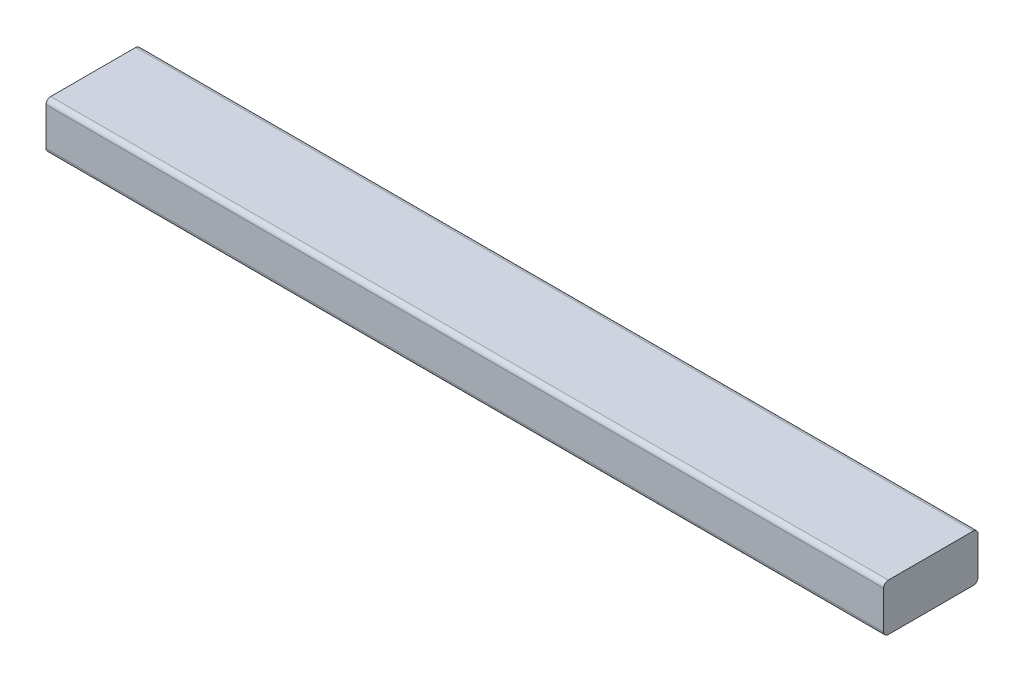
ISO-10303-21;
HEADER;
FILE_DESCRIPTION(('STEP AP214'),'2;1');
FILE_NAME('part.step','',(''),(''),'','','');
FILE_SCHEMA(('AUTOMOTIVE_DESIGN { 1 0 10303 214 1 1 1 1 }'));
ENDSEC;
DATA;
#1=APPLICATION_CONTEXT('core data for automotive mechanical design processes');
#2=APPLICATION_PROTOCOL_DEFINITION('international standard','automotive_design',2000,#1);
#3=PRODUCT_CONTEXT('',#1,'mechanical');
#4=PRODUCT('Part','Part','',(#3));
#5=PRODUCT_RELATED_PRODUCT_CATEGORY('part','',(#4));
#6=PRODUCT_DEFINITION_FORMATION('','',#4);
#7=PRODUCT_DEFINITION_CONTEXT('part definition',#1,'design');
#8=PRODUCT_DEFINITION('design','',#6,#7);
#9=PRODUCT_DEFINITION_SHAPE('','',#8);
#10=(LENGTH_UNIT() NAMED_UNIT(*) SI_UNIT(.MILLI.,.METRE.));
#11=(NAMED_UNIT(*) PLANE_ANGLE_UNIT() SI_UNIT($,.RADIAN.));
#12=(NAMED_UNIT(*) SI_UNIT($,.STERADIAN.) SOLID_ANGLE_UNIT());
#13=UNCERTAINTY_MEASURE_WITH_UNIT(LENGTH_MEASURE(1.E-05),#10,'distance_accuracy_value','');
#14=(GEOMETRIC_REPRESENTATION_CONTEXT(3) GLOBAL_UNCERTAINTY_ASSIGNED_CONTEXT((#13)) GLOBAL_UNIT_ASSIGNED_CONTEXT((#10,
#11,#12)) REPRESENTATION_CONTEXT('',''));
#15=CARTESIAN_POINT('',(0.,0.,0.));
#16=DIRECTION('',(0.,0.,1.));
#17=DIRECTION('',(1.,0.,0.));
#18=AXIS2_PLACEMENT_3D('',#15,#16,#17);
#19=CARTESIAN_POINT('',(2714.29999999996,38.0999999999986,-389.300000000002));
#20=DIRECTION('',(1.,0.,0.));
#21=DIRECTION('',(0.,1.,0.));
#22=AXIS2_PLACEMENT_3D('',#19,#20,#21);
#23=PLANE('',#22);
#24=DIRECTION('',(0.,-1.,0.));
#25=VECTOR('',#24,1.);
#26=CARTESIAN_POINT('',(2714.29999999996,38.1000000000004,-287.700000000002));
#27=LINE('',#26,#25);
#28=CARTESIAN_POINT('',(2714.29999999996,33.0200000000004,-287.700000000002));
#29=VERTEX_POINT('',#28);
#30=CARTESIAN_POINT('',(2714.29999999996,-7.61999999999961,-287.700000000001));
#31=VERTEX_POINT('',#30);
#32=EDGE_CURVE('E172',#29,#31,#27,.T.);
#33=ORIENTED_EDGE('',*,*,#32,.T.);
#34=CARTESIAN_POINT('',(2714.29999999996,-7.6199999999997,-292.780000000001));
#35=DIRECTION('',(1.,0.,0.));
#36=DIRECTION('',(0.,1.,0.));
#37=AXIS2_PLACEMENT_3D('',#34,#35,#36);
#38=CIRCLE('',#37,5.08);
#39=CARTESIAN_POINT('',(2714.29999999996,-12.6999999999997,-292.780000000001));
#40=VERTEX_POINT('',#39);
#41=EDGE_CURVE('E135',#31,#40,#38,.T.);
#42=ORIENTED_EDGE('',*,*,#41,.T.);
#43=DIRECTION('',(0.,0.,1.));
#44=VECTOR('',#43,1.);
#45=CARTESIAN_POINT('',(2714.29999999996,-12.7000000000014,-389.300000000001));
#46=LINE('',#45,#44);
#47=CARTESIAN_POINT('',(2714.29999999996,-12.7000000000013,-384.220000000001));
#48=VERTEX_POINT('',#47);
#49=EDGE_CURVE('E143',#48,#40,#46,.T.);
#50=ORIENTED_EDGE('',*,*,#49,.F.);
#51=CARTESIAN_POINT('',(2714.29999999996,-7.62000000000135,-384.220000000001));
#52=DIRECTION('',(1.,0.,0.));
#53=DIRECTION('',(0.,1.,0.));
#54=AXIS2_PLACEMENT_3D('',#51,#52,#53);
#55=CIRCLE('',#54,5.08);
#56=CARTESIAN_POINT('',(2714.29999999996,-7.62000000000144,-389.300000000001));
#57=VERTEX_POINT('',#56);
#58=EDGE_CURVE('E126',#48,#57,#55,.T.);
#59=ORIENTED_EDGE('',*,*,#58,.T.);
#60=DIRECTION('',(0.,-1.,0.));
#61=VECTOR('',#60,1.);
#62=CARTESIAN_POINT('',(2714.29999999996,38.0999999999986,-389.300000000002));
#63=LINE('',#62,#61);
#64=CARTESIAN_POINT('',(2714.29999999996,33.0199999999986,-389.300000000002));
#65=VERTEX_POINT('',#64);
#66=EDGE_CURVE('E149',#65,#57,#63,.T.);
#67=ORIENTED_EDGE('',*,*,#66,.F.);
#68=CARTESIAN_POINT('',(2714.29999999996,33.0199999999986,-384.220000000002));
#69=DIRECTION('',(1.,0.,0.));
#70=DIRECTION('',(0.,1.,0.));
#71=AXIS2_PLACEMENT_3D('',#68,#69,#70);
#72=CIRCLE('',#71,5.08);
#73=CARTESIAN_POINT('',(2714.29999999996,38.0999999999987,-384.220000000002));
#74=VERTEX_POINT('',#73);
#75=EDGE_CURVE('E82',#65,#74,#72,.T.);
#76=ORIENTED_EDGE('',*,*,#75,.T.);
#77=DIRECTION('',(0.,0.,1.));
#78=VECTOR('',#77,1.);
#79=CARTESIAN_POINT('',(2714.29999999996,38.0999999999986,-389.300000000002));
#80=LINE('',#79,#78);
#81=CARTESIAN_POINT('',(2714.29999999996,38.1000000000003,-292.780000000002));
#82=VERTEX_POINT('',#81);
#83=EDGE_CURVE('E156',#74,#82,#80,.T.);
#84=ORIENTED_EDGE('',*,*,#83,.T.);
#85=CARTESIAN_POINT('',(2714.29999999996,33.0200000000003,-292.780000000002));
#86=DIRECTION('',(1.,0.,0.));
#87=DIRECTION('',(0.,1.,0.));
#88=AXIS2_PLACEMENT_3D('',#85,#86,#87);
#89=CIRCLE('',#88,5.08);
#90=EDGE_CURVE('E136',#82,#29,#89,.T.);
#91=ORIENTED_EDGE('',*,*,#90,.T.);
#92=EDGE_LOOP('',(#33,#42,#50,#59,#67,#76,#84,#91));
#93=FACE_BOUND('',#92,.T.);
#94=ADVANCED_FACE('F61',(#93),#23,.T.);
#95=CARTESIAN_POINT('',(2714.29999999996,38.0999999999986,-389.300000000002));
#96=DIRECTION('',(0.,0.,-1.));
#97=DIRECTION('',(0.,1.,0.));
#98=AXIS2_PLACEMENT_3D('',#95,#96,#97);
#99=PLANE('',#98);
#100=ORIENTED_EDGE('',*,*,#66,.T.);
#101=DIRECTION('',(1.,0.,0.));
#102=VECTOR('',#101,1.);
#103=CARTESIAN_POINT('',(2714.29999999996,-7.62000000000145,-389.300000000001));
#104=LINE('',#103,#102);
#105=CARTESIAN_POINT('',(1812.69999999996,-7.62000000000616,-389.300000000001));
#106=VERTEX_POINT('',#105);
#107=EDGE_CURVE('E131',#57,#106,#104,.F.);
#108=ORIENTED_EDGE('',*,*,#107,.T.);
#109=DIRECTION('',(0.,-1.,0.));
#110=VECTOR('',#109,1.);
#111=CARTESIAN_POINT('',(1812.69999999996,38.0999999999938,-389.300000000002));
#112=LINE('',#111,#110);
#113=CARTESIAN_POINT('',(1812.69999999996,33.0199999999938,-389.300000000002));
#114=VERTEX_POINT('',#113);
#115=EDGE_CURVE('E164',#114,#106,#112,.T.);
#116=ORIENTED_EDGE('',*,*,#115,.F.);
#117=DIRECTION('',(1.,0.,0.));
#118=VECTOR('',#117,1.);
#119=CARTESIAN_POINT('',(2714.29999999996,33.0199999999986,-389.300000000002));
#120=LINE('',#119,#118);
#121=EDGE_CURVE('E202',#114,#65,#120,.T.);
#122=ORIENTED_EDGE('',*,*,#121,.T.);
#123=EDGE_LOOP('',(#100,#108,#116,#122));
#124=FACE_BOUND('',#123,.T.);
#125=ADVANCED_FACE('F220',(#124),#99,.T.);
#126=CARTESIAN_POINT('',(1812.69999999996,38.0999999999938,-389.300000000002));
#127=DIRECTION('',(-1.,0.,0.));
#128=DIRECTION('',(0.,-1.,0.));
#129=AXIS2_PLACEMENT_3D('',#126,#127,#128);
#130=PLANE('',#129);
#131=DIRECTION('',(0.,0.,-1.));
#132=VECTOR('',#131,1.);
#133=CARTESIAN_POINT('',(1812.69999999996,-12.7000000000062,-389.300000000001));
#134=LINE('',#133,#132);
#135=CARTESIAN_POINT('',(1812.69999999996,-12.7000000000044,-292.780000000001));
#136=VERTEX_POINT('',#135);
#137=CARTESIAN_POINT('',(1812.69999999996,-12.7000000000061,-384.220000000001));
#138=VERTEX_POINT('',#137);
#139=EDGE_CURVE('E146',#136,#138,#134,.T.);
#140=ORIENTED_EDGE('',*,*,#139,.F.);
#141=CARTESIAN_POINT('',(1812.69999999996,-7.62000000000441,-292.780000000001));
#142=DIRECTION('',(-1.,0.,0.));
#143=DIRECTION('',(0.,-1.,0.));
#144=AXIS2_PLACEMENT_3D('',#141,#142,#143);
#145=CIRCLE('',#144,5.08);
#146=CARTESIAN_POINT('',(1812.69999999996,-7.62000000000432,-287.700000000001));
#147=VERTEX_POINT('',#146);
#148=EDGE_CURVE('E186',#136,#147,#145,.T.);
#149=ORIENTED_EDGE('',*,*,#148,.T.);
#150=DIRECTION('',(0.,-1.,0.));
#151=VECTOR('',#150,1.);
#152=CARTESIAN_POINT('',(1812.69999999996,38.0999999999957,-287.700000000002));
#153=LINE('',#152,#151);
#154=CARTESIAN_POINT('',(1812.69999999996,33.0199999999957,-287.700000000002));
#155=VERTEX_POINT('',#154);
#156=EDGE_CURVE('E168',#155,#147,#153,.T.);
#157=ORIENTED_EDGE('',*,*,#156,.F.);
#158=CARTESIAN_POINT('',(1812.69999999996,33.0199999999956,-292.780000000002));
#159=DIRECTION('',(-1.,0.,0.));
#160=DIRECTION('',(0.,-1.,0.));
#161=AXIS2_PLACEMENT_3D('',#158,#159,#160);
#162=CIRCLE('',#161,5.08);
#163=CARTESIAN_POINT('',(1812.69999999996,38.0999999999956,-292.780000000002));
#164=VERTEX_POINT('',#163);
#165=EDGE_CURVE('E180',#155,#164,#162,.T.);
#166=ORIENTED_EDGE('',*,*,#165,.T.);
#167=DIRECTION('',(0.,0.,-1.));
#168=VECTOR('',#167,1.);
#169=CARTESIAN_POINT('',(1812.69999999996,38.0999999999938,-389.300000000002));
#170=LINE('',#169,#168);
#171=CARTESIAN_POINT('',(1812.69999999996,38.0999999999939,-384.220000000002));
#172=VERTEX_POINT('',#171);
#173=EDGE_CURVE('E159',#164,#172,#170,.T.);
#174=ORIENTED_EDGE('',*,*,#173,.T.);
#175=CARTESIAN_POINT('',(1812.69999999996,33.0199999999939,-384.220000000002));
#176=DIRECTION('',(-1.,0.,0.));
#177=DIRECTION('',(0.,-1.,0.));
#178=AXIS2_PLACEMENT_3D('',#175,#176,#177);
#179=CIRCLE('',#178,5.08);
#180=EDGE_CURVE('E177',#172,#114,#179,.T.);
#181=ORIENTED_EDGE('',*,*,#180,.T.);
#182=ORIENTED_EDGE('',*,*,#115,.T.);
#183=CARTESIAN_POINT('',(1812.69999999996,-7.62000000000606,-384.220000000001));
#184=DIRECTION('',(-1.,0.,0.));
#185=DIRECTION('',(0.,-1.,0.));
#186=AXIS2_PLACEMENT_3D('',#183,#184,#185);
#187=CIRCLE('',#186,5.08);
#188=EDGE_CURVE('E183',#106,#138,#187,.T.);
#189=ORIENTED_EDGE('',*,*,#188,.T.);
#190=EDGE_LOOP('',(#140,#149,#157,#166,#174,#181,#182,#189));
#191=FACE_BOUND('',#190,.T.);
#192=ADVANCED_FACE('F214',(#191),#130,.T.);
#193=CARTESIAN_POINT('',(2714.29999999996,38.1000000000004,-287.700000000002));
#194=DIRECTION('',(0.,0.,1.));
#195=DIRECTION('',(0.,-1.,0.));
#196=AXIS2_PLACEMENT_3D('',#193,#194,#195);
#197=PLANE('',#196);
#198=ORIENTED_EDGE('',*,*,#156,.T.);
#199=DIRECTION('',(-1.,0.,0.));
#200=VECTOR('',#199,1.);
#201=CARTESIAN_POINT('',(2714.29999999996,-7.61999999999961,-287.700000000001));
#202=LINE('',#201,#200);
#203=EDGE_CURVE('E193',#147,#31,#202,.F.);
#204=ORIENTED_EDGE('',*,*,#203,.T.);
#205=ORIENTED_EDGE('',*,*,#32,.F.);
#206=DIRECTION('',(-1.,0.,0.));
#207=VECTOR('',#206,1.);
#208=CARTESIAN_POINT('',(1812.69999999996,33.0199999999957,-287.700000000002));
#209=LINE('',#208,#207);
#210=EDGE_CURVE('E189',#29,#155,#209,.T.);
#211=ORIENTED_EDGE('',*,*,#210,.T.);
#212=EDGE_LOOP('',(#198,#204,#205,#211));
#213=FACE_BOUND('',#212,.T.);
#214=ADVANCED_FACE('F224',(#213),#197,.T.);
#215=CARTESIAN_POINT('',(-1.99220196198041E-13,38.0999999999914,-6.8906450224136E-13));
#216=DIRECTION('',(0.,-1.,0.));
#217=DIRECTION('',(0.,0.,-1.));
#218=AXIS2_PLACEMENT_3D('',#215,#216,#217);
#219=PLANE('',#218);
#220=ORIENTED_EDGE('',*,*,#173,.F.);
#221=DIRECTION('',(-1.,0.,0.));
#222=VECTOR('',#221,1.);
#223=CARTESIAN_POINT('',(2714.29999999996,38.1000000000003,-292.780000000002));
#224=LINE('',#223,#222);
#225=EDGE_CURVE('E12',#164,#82,#224,.F.);
#226=ORIENTED_EDGE('',*,*,#225,.T.);
#227=ORIENTED_EDGE('',*,*,#83,.F.);
#228=DIRECTION('',(1.,0.,0.));
#229=VECTOR('',#228,1.);
#230=CARTESIAN_POINT('',(1812.69999999996,38.0999999999939,-384.220000000002));
#231=LINE('',#230,#229);
#232=EDGE_CURVE('E70',#74,#172,#231,.F.);
#233=ORIENTED_EDGE('',*,*,#232,.T.);
#234=EDGE_LOOP('',(#220,#226,#227,#233));
#235=FACE_BOUND('',#234,.T.);
#236=ADVANCED_FACE('F210',(#235),#219,.F.);
#237=CARTESIAN_POINT('',(0.,-12.7000000000086,2.29417179698088E-13));
#238=DIRECTION('',(0.,-1.,0.));
#239=DIRECTION('',(0.,0.,-1.));
#240=AXIS2_PLACEMENT_3D('',#237,#238,#239);
#241=PLANE('',#240);
#242=ORIENTED_EDGE('',*,*,#49,.T.);
#243=DIRECTION('',(-1.,0.,0.));
#244=VECTOR('',#243,1.);
#245=CARTESIAN_POINT('',(0.,-12.7000000000139,-292.780000000001));
#246=LINE('',#245,#244);
#247=EDGE_CURVE('E148',#40,#136,#246,.T.);
#248=ORIENTED_EDGE('',*,*,#247,.T.);
#249=ORIENTED_EDGE('',*,*,#139,.T.);
#250=DIRECTION('',(1.,0.,0.));
#251=VECTOR('',#250,1.);
#252=CARTESIAN_POINT('',(0.,-12.7000000000155,-384.220000000001));
#253=LINE('',#252,#251);
#254=EDGE_CURVE('E130',#138,#48,#253,.T.);
#255=ORIENTED_EDGE('',*,*,#254,.T.);
#256=EDGE_LOOP('',(#242,#248,#249,#255));
#257=FACE_BOUND('',#256,.T.);
#258=ADVANCED_FACE('F141',(#257),#241,.T.);
#259=CARTESIAN_POINT('',(0.,-7.62000000001389,-292.780000000001));
#260=DIRECTION('',(-1.,0.,0.));
#261=DIRECTION('',(0.,-1.,0.));
#262=AXIS2_PLACEMENT_3D('',#259,#260,#261);
#263=CYLINDRICAL_SURFACE('',#262,5.08);
#264=ORIENTED_EDGE('',*,*,#41,.F.);
#265=ORIENTED_EDGE('',*,*,#203,.F.);
#266=ORIENTED_EDGE('',*,*,#148,.F.);
#267=ORIENTED_EDGE('',*,*,#247,.F.);
#268=EDGE_LOOP('',(#264,#265,#266,#267));
#269=FACE_BOUND('',#268,.T.);
#270=ADVANCED_FACE('F227',(#269),#263,.T.);
#271=CARTESIAN_POINT('',(0.,-7.62000000001554,-384.220000000001));
#272=DIRECTION('',(1.,0.,0.));
#273=DIRECTION('',(0.,1.,0.));
#274=AXIS2_PLACEMENT_3D('',#271,#272,#273);
#275=CYLINDRICAL_SURFACE('',#274,5.08);
#276=ORIENTED_EDGE('',*,*,#188,.F.);
#277=ORIENTED_EDGE('',*,*,#107,.F.);
#278=ORIENTED_EDGE('',*,*,#58,.F.);
#279=ORIENTED_EDGE('',*,*,#254,.F.);
#280=EDGE_LOOP('',(#276,#277,#278,#279));
#281=FACE_BOUND('',#280,.T.);
#282=ADVANCED_FACE('F129',(#281),#275,.T.);
#283=CARTESIAN_POINT('',(2714.29999999996,33.0200000000003,-292.780000000002));
#284=DIRECTION('',(1.,0.,0.));
#285=DIRECTION('',(0.,1.,0.));
#286=AXIS2_PLACEMENT_3D('',#283,#284,#285);
#287=CYLINDRICAL_SURFACE('',#286,5.08);
#288=ORIENTED_EDGE('',*,*,#90,.F.);
#289=ORIENTED_EDGE('',*,*,#225,.F.);
#290=ORIENTED_EDGE('',*,*,#165,.F.);
#291=ORIENTED_EDGE('',*,*,#210,.F.);
#292=EDGE_LOOP('',(#288,#289,#290,#291));
#293=FACE_BOUND('',#292,.T.);
#294=ADVANCED_FACE('F234',(#293),#287,.T.);
#295=CARTESIAN_POINT('',(2714.29999999996,33.0199999999986,-384.220000000002));
#296=DIRECTION('',(-1.,0.,0.));
#297=DIRECTION('',(0.,-1.,0.));
#298=AXIS2_PLACEMENT_3D('',#295,#296,#297);
#299=CYLINDRICAL_SURFACE('',#298,5.08);
#300=ORIENTED_EDGE('',*,*,#180,.F.);
#301=ORIENTED_EDGE('',*,*,#232,.F.);
#302=ORIENTED_EDGE('',*,*,#75,.F.);
#303=ORIENTED_EDGE('',*,*,#121,.F.);
#304=EDGE_LOOP('',(#300,#301,#302,#303));
#305=FACE_BOUND('',#304,.T.);
#306=ADVANCED_FACE('F63',(#305),#299,.T.);
#307=CLOSED_SHELL('',(#94,#125,#192,#214,#236,#258,#270,#282,#294,#306));
#308=MANIFOLD_SOLID_BREP('B2',#307);
#309=ADVANCED_BREP_SHAPE_REPRESENTATION('',(#18,#308),#14);
#310=SHAPE_DEFINITION_REPRESENTATION(#9,#309);
ENDSEC;
END-ISO-10303-21;
